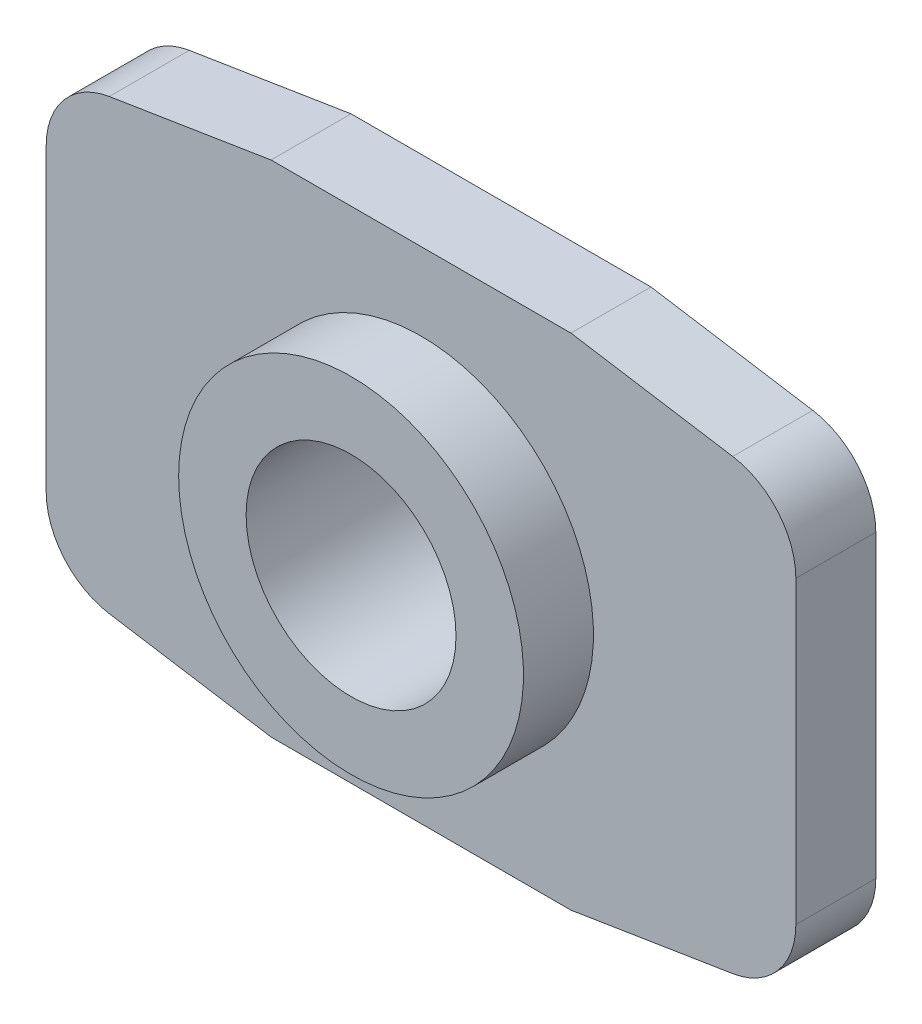
ISO-10303-21;
HEADER;
FILE_DESCRIPTION(('STEP AP214'),'2;1');
FILE_NAME('part.step','',(''),(''),'','','');
FILE_SCHEMA(('AUTOMOTIVE_DESIGN { 1 0 10303 214 1 1 1 1 }'));
ENDSEC;
DATA;
#1=APPLICATION_CONTEXT('core data for automotive mechanical design processes');
#2=APPLICATION_PROTOCOL_DEFINITION('international standard','automotive_design',2000,#1);
#3=PRODUCT_CONTEXT('',#1,'mechanical');
#4=PRODUCT('Part','Part','',(#3));
#5=PRODUCT_RELATED_PRODUCT_CATEGORY('part','',(#4));
#6=PRODUCT_DEFINITION_FORMATION('','',#4);
#7=PRODUCT_DEFINITION_CONTEXT('part definition',#1,'design');
#8=PRODUCT_DEFINITION('design','',#6,#7);
#9=PRODUCT_DEFINITION_SHAPE('','',#8);
#10=(LENGTH_UNIT() NAMED_UNIT(*) SI_UNIT(.MILLI.,.METRE.));
#11=(NAMED_UNIT(*) PLANE_ANGLE_UNIT() SI_UNIT($,.RADIAN.));
#12=(NAMED_UNIT(*) SI_UNIT($,.STERADIAN.) SOLID_ANGLE_UNIT());
#13=UNCERTAINTY_MEASURE_WITH_UNIT(LENGTH_MEASURE(1.E-05),#10,'distance_accuracy_value','');
#14=(GEOMETRIC_REPRESENTATION_CONTEXT(3) GLOBAL_UNCERTAINTY_ASSIGNED_CONTEXT((#13)) GLOBAL_UNIT_ASSIGNED_CONTEXT((#10,
#11,#12)) REPRESENTATION_CONTEXT('',''));
#15=CARTESIAN_POINT('',(0.,0.,0.));
#16=DIRECTION('',(0.,0.,1.));
#17=DIRECTION('',(1.,0.,0.));
#18=AXIS2_PLACEMENT_3D('',#15,#16,#17);
#19=CARTESIAN_POINT('',(-3.,-5.,0.));
#20=DIRECTION('',(0.,-1.,0.));
#21=DIRECTION('',(0.,0.,-1.));
#22=AXIS2_PLACEMENT_3D('',#19,#20,#21);
#23=PLANE('',#22);
#24=DIRECTION('',(1.,0.,0.));
#25=VECTOR('',#24,1.);
#26=CARTESIAN_POINT('',(-3.,-5.,1.6));
#27=LINE('',#26,#25);
#28=CARTESIAN_POINT('',(-3.,-5.,1.6));
#29=VERTEX_POINT('',#28);
#30=CARTESIAN_POINT('',(3.,-5.,1.6));
#31=VERTEX_POINT('',#30);
#32=EDGE_CURVE('E165',#29,#31,#27,.T.);
#33=ORIENTED_EDGE('',*,*,#32,.F.);
#34=DIRECTION('',(0.,0.,1.));
#35=VECTOR('',#34,1.);
#36=CARTESIAN_POINT('',(-3.,-5.,0.));
#37=LINE('',#36,#35);
#38=CARTESIAN_POINT('',(-3.,-5.,0.));
#39=VERTEX_POINT('',#38);
#40=EDGE_CURVE('E145',#39,#29,#37,.T.);
#41=ORIENTED_EDGE('',*,*,#40,.F.);
#42=DIRECTION('',(1.,0.,0.));
#43=VECTOR('',#42,1.);
#44=CARTESIAN_POINT('',(-3.,-5.,0.));
#45=LINE('',#44,#43);
#46=CARTESIAN_POINT('',(3.,-5.,0.));
#47=VERTEX_POINT('',#46);
#48=EDGE_CURVE('E140',#39,#47,#45,.T.);
#49=ORIENTED_EDGE('',*,*,#48,.T.);
#50=DIRECTION('',(0.,0.,1.));
#51=VECTOR('',#50,1.);
#52=CARTESIAN_POINT('',(3.,-5.,0.));
#53=LINE('',#52,#51);
#54=EDGE_CURVE('E122',#47,#31,#53,.T.);
#55=ORIENTED_EDGE('',*,*,#54,.T.);
#56=EDGE_LOOP('',(#33,#41,#49,#55));
#57=FACE_BOUND('',#56,.T.);
#58=ADVANCED_FACE('F32',(#57),#23,.T.);
#59=CARTESIAN_POINT('',(-7.5,-4.278719262151,0.));
#60=DIRECTION('',(-0.158264501869385,-0.987396752804077,0.));
#61=DIRECTION('',(0.987396752804077,-0.158264501869385,0.));
#62=AXIS2_PLACEMENT_3D('',#59,#60,#61);
#63=PLANE('',#62);
#64=DIRECTION('',(0.987396752804077,-0.158264501869385,0.));
#65=VECTOR('',#64,1.);
#66=CARTESIAN_POINT('',(-7.5,-4.278719262151,1.6));
#67=LINE('',#66,#65);
#68=CARTESIAN_POINT('',(-6.23739675280408,-4.48109512920611,1.6));
#69=VERTEX_POINT('',#68);
#70=EDGE_CURVE('E146',#69,#29,#67,.T.);
#71=ORIENTED_EDGE('',*,*,#70,.F.);
#72=DIRECTION('',(0.,0.,1.));
#73=VECTOR('',#72,1.);
#74=CARTESIAN_POINT('',(-6.23739675280408,-4.48109512920611,0.));
#75=LINE('',#74,#73);
#76=CARTESIAN_POINT('',(-6.23739675280408,-4.48109512920611,0.));
#77=VERTEX_POINT('',#76);
#78=EDGE_CURVE('E11',#69,#77,#75,.F.);
#79=ORIENTED_EDGE('',*,*,#78,.T.);
#80=DIRECTION('',(0.987396752804077,-0.158264501869385,0.));
#81=VECTOR('',#80,1.);
#82=CARTESIAN_POINT('',(-7.5,-4.278719262151,0.));
#83=LINE('',#82,#81);
#84=EDGE_CURVE('E134',#77,#39,#83,.T.);
#85=ORIENTED_EDGE('',*,*,#84,.T.);
#86=ORIENTED_EDGE('',*,*,#40,.T.);
#87=EDGE_LOOP('',(#71,#79,#85,#86));
#88=FACE_BOUND('',#87,.T.);
#89=ADVANCED_FACE('F257',(#88),#63,.T.);
#90=CARTESIAN_POINT('',(-7.5,4.27871926215099,0.));
#91=DIRECTION('',(-1.,0.,0.));
#92=DIRECTION('',(0.,-1.,0.));
#93=AXIS2_PLACEMENT_3D('',#90,#91,#92);
#94=PLANE('',#93);
#95=DIRECTION('',(0.,-1.,0.));
#96=VECTOR('',#95,1.);
#97=CARTESIAN_POINT('',(-7.5,4.27871926215099,1.6));
#98=LINE('',#97,#96);
#99=CARTESIAN_POINT('',(-7.5,3.,1.6));
#100=VERTEX_POINT('',#99);
#101=CARTESIAN_POINT('',(-7.5,-3.,1.6));
#102=VERTEX_POINT('',#101);
#103=EDGE_CURVE('E148',#100,#102,#98,.T.);
#104=ORIENTED_EDGE('',*,*,#103,.F.);
#105=DIRECTION('',(0.,0.,1.));
#106=VECTOR('',#105,1.);
#107=CARTESIAN_POINT('',(-7.5,3.,0.));
#108=LINE('',#107,#106);
#109=CARTESIAN_POINT('',(-7.5,3.,0.));
#110=VERTEX_POINT('',#109);
#111=EDGE_CURVE('E40',#100,#110,#108,.F.);
#112=ORIENTED_EDGE('',*,*,#111,.T.);
#113=DIRECTION('',(0.,-1.,0.));
#114=VECTOR('',#113,1.);
#115=CARTESIAN_POINT('',(-7.5,4.27871926215099,0.));
#116=LINE('',#115,#114);
#117=CARTESIAN_POINT('',(-7.5,-3.,0.));
#118=VERTEX_POINT('',#117);
#119=EDGE_CURVE('E161',#110,#118,#116,.T.);
#120=ORIENTED_EDGE('',*,*,#119,.T.);
#121=DIRECTION('',(0.,0.,1.));
#122=VECTOR('',#121,1.);
#123=CARTESIAN_POINT('',(-7.5,-3.,0.));
#124=LINE('',#123,#122);
#125=EDGE_CURVE('E214',#118,#102,#124,.T.);
#126=ORIENTED_EDGE('',*,*,#125,.T.);
#127=EDGE_LOOP('',(#104,#112,#120,#126));
#128=FACE_BOUND('',#127,.T.);
#129=ADVANCED_FACE('F219',(#128),#94,.T.);
#130=CARTESIAN_POINT('',(-3.,5.,0.));
#131=DIRECTION('',(-0.158264501869386,0.987396752804077,0.));
#132=DIRECTION('',(-0.987396752804077,-0.158264501869386,0.));
#133=AXIS2_PLACEMENT_3D('',#130,#131,#132);
#134=PLANE('',#133);
#135=DIRECTION('',(-0.987396752804077,-0.158264501869386,0.));
#136=VECTOR('',#135,1.);
#137=CARTESIAN_POINT('',(-3.,5.,0.));
#138=LINE('',#137,#136);
#139=CARTESIAN_POINT('',(-3.,5.,0.));
#140=VERTEX_POINT('',#139);
#141=CARTESIAN_POINT('',(-6.23739675280408,4.48109512920611,0.));
#142=VERTEX_POINT('',#141);
#143=EDGE_CURVE('E159',#140,#142,#138,.T.);
#144=ORIENTED_EDGE('',*,*,#143,.T.);
#145=DIRECTION('',(0.,0.,1.));
#146=VECTOR('',#145,1.);
#147=CARTESIAN_POINT('',(-6.23739675280408,4.48109512920611,0.));
#148=LINE('',#147,#146);
#149=CARTESIAN_POINT('',(-6.23739675280408,4.48109512920611,1.6));
#150=VERTEX_POINT('',#149);
#151=EDGE_CURVE('E211',#142,#150,#148,.T.);
#152=ORIENTED_EDGE('',*,*,#151,.T.);
#153=DIRECTION('',(-0.987396752804077,-0.158264501869386,0.));
#154=VECTOR('',#153,1.);
#155=CARTESIAN_POINT('',(-3.,5.,1.6));
#156=LINE('',#155,#154);
#157=CARTESIAN_POINT('',(-3.,5.,1.6));
#158=VERTEX_POINT('',#157);
#159=EDGE_CURVE('E174',#158,#150,#156,.T.);
#160=ORIENTED_EDGE('',*,*,#159,.F.);
#161=DIRECTION('',(0.,0.,1.));
#162=VECTOR('',#161,1.);
#163=CARTESIAN_POINT('',(-3.,5.,0.));
#164=LINE('',#163,#162);
#165=EDGE_CURVE('E181',#140,#158,#164,.T.);
#166=ORIENTED_EDGE('',*,*,#165,.F.);
#167=EDGE_LOOP('',(#144,#152,#160,#166));
#168=FACE_BOUND('',#167,.T.);
#169=ADVANCED_FACE('F227',(#168),#134,.T.);
#170=CARTESIAN_POINT('',(3.,5.,0.));
#171=DIRECTION('',(0.,1.,0.));
#172=DIRECTION('',(-1.,0.,0.));
#173=AXIS2_PLACEMENT_3D('',#170,#171,#172);
#174=PLANE('',#173);
#175=DIRECTION('',(-1.,0.,0.));
#176=VECTOR('',#175,1.);
#177=CARTESIAN_POINT('',(3.,5.,1.6));
#178=LINE('',#177,#176);
#179=CARTESIAN_POINT('',(3.,5.,1.6));
#180=VERTEX_POINT('',#179);
#181=EDGE_CURVE('E171',#180,#158,#178,.T.);
#182=ORIENTED_EDGE('',*,*,#181,.F.);
#183=DIRECTION('',(0.,0.,1.));
#184=VECTOR('',#183,1.);
#185=CARTESIAN_POINT('',(3.,5.,0.));
#186=LINE('',#185,#184);
#187=CARTESIAN_POINT('',(3.,5.,0.));
#188=VERTEX_POINT('',#187);
#189=EDGE_CURVE('E133',#188,#180,#186,.T.);
#190=ORIENTED_EDGE('',*,*,#189,.F.);
#191=DIRECTION('',(-1.,0.,0.));
#192=VECTOR('',#191,1.);
#193=CARTESIAN_POINT('',(3.,5.,0.));
#194=LINE('',#193,#192);
#195=EDGE_CURVE('E156',#188,#140,#194,.T.);
#196=ORIENTED_EDGE('',*,*,#195,.T.);
#197=ORIENTED_EDGE('',*,*,#165,.T.);
#198=EDGE_LOOP('',(#182,#190,#196,#197));
#199=FACE_BOUND('',#198,.T.);
#200=ADVANCED_FACE('F234',(#199),#174,.T.);
#201=CARTESIAN_POINT('',(7.5,4.278719262151,0.));
#202=DIRECTION('',(0.158264501869385,0.987396752804077,0.));
#203=DIRECTION('',(-0.987396752804077,0.158264501869385,0.));
#204=AXIS2_PLACEMENT_3D('',#201,#202,#203);
#205=PLANE('',#204);
#206=DIRECTION('',(-0.987396752804077,0.158264501869385,0.));
#207=VECTOR('',#206,1.);
#208=CARTESIAN_POINT('',(7.5,4.278719262151,1.6));
#209=LINE('',#208,#207);
#210=CARTESIAN_POINT('',(6.23739675280408,4.48109512920611,1.6));
#211=VERTEX_POINT('',#210);
#212=EDGE_CURVE('E169',#211,#180,#209,.T.);
#213=ORIENTED_EDGE('',*,*,#212,.F.);
#214=DIRECTION('',(0.,0.,1.));
#215=VECTOR('',#214,1.);
#216=CARTESIAN_POINT('',(6.23739675280408,4.48109512920611,0.));
#217=LINE('',#216,#215);
#218=CARTESIAN_POINT('',(6.23739675280408,4.48109512920611,0.));
#219=VERTEX_POINT('',#218);
#220=EDGE_CURVE('E201',#211,#219,#217,.F.);
#221=ORIENTED_EDGE('',*,*,#220,.T.);
#222=DIRECTION('',(-0.987396752804077,0.158264501869385,0.));
#223=VECTOR('',#222,1.);
#224=CARTESIAN_POINT('',(7.5,4.278719262151,0.));
#225=LINE('',#224,#223);
#226=EDGE_CURVE('E154',#219,#188,#225,.T.);
#227=ORIENTED_EDGE('',*,*,#226,.T.);
#228=ORIENTED_EDGE('',*,*,#189,.T.);
#229=EDGE_LOOP('',(#213,#221,#227,#228));
#230=FACE_BOUND('',#229,.T.);
#231=ADVANCED_FACE('F268',(#230),#205,.T.);
#232=CARTESIAN_POINT('',(7.5,4.278719262151,0.));
#233=DIRECTION('',(1.,0.,0.));
#234=DIRECTION('',(0.,1.,0.));
#235=AXIS2_PLACEMENT_3D('',#232,#233,#234);
#236=PLANE('',#235);
#237=DIRECTION('',(0.,1.,0.));
#238=VECTOR('',#237,1.);
#239=CARTESIAN_POINT('',(7.5,4.278719262151,0.));
#240=LINE('',#239,#238);
#241=CARTESIAN_POINT('',(7.50000000000002,-2.99999999999999,0.));
#242=VERTEX_POINT('',#241);
#243=CARTESIAN_POINT('',(7.5,3.,0.));
#244=VERTEX_POINT('',#243);
#245=EDGE_CURVE('E141',#242,#244,#240,.T.);
#246=ORIENTED_EDGE('',*,*,#245,.T.);
#247=DIRECTION('',(0.,0.,1.));
#248=VECTOR('',#247,1.);
#249=CARTESIAN_POINT('',(7.5,3.,0.));
#250=LINE('',#249,#248);
#251=CARTESIAN_POINT('',(7.5,3.,1.6));
#252=VERTEX_POINT('',#251);
#253=EDGE_CURVE('E190',#244,#252,#250,.T.);
#254=ORIENTED_EDGE('',*,*,#253,.T.);
#255=DIRECTION('',(0.,1.,0.));
#256=VECTOR('',#255,1.);
#257=CARTESIAN_POINT('',(7.5,4.278719262151,1.6));
#258=LINE('',#257,#256);
#259=CARTESIAN_POINT('',(7.50000000000002,-2.99999999999999,1.6));
#260=VERTEX_POINT('',#259);
#261=EDGE_CURVE('E168',#260,#252,#258,.T.);
#262=ORIENTED_EDGE('',*,*,#261,.F.);
#263=DIRECTION('',(0.,0.,1.));
#264=VECTOR('',#263,1.);
#265=CARTESIAN_POINT('',(7.50000000000002,-2.99999999999999,0.));
#266=LINE('',#265,#264);
#267=EDGE_CURVE('E180',#260,#242,#266,.F.);
#268=ORIENTED_EDGE('',*,*,#267,.T.);
#269=EDGE_LOOP('',(#246,#254,#262,#268));
#270=FACE_BOUND('',#269,.T.);
#271=ADVANCED_FACE('F244',(#270),#236,.T.);
#272=CARTESIAN_POINT('',(3.,-5.,0.));
#273=DIRECTION('',(0.158264501869385,-0.987396752804077,0.));
#274=DIRECTION('',(0.987396752804077,0.158264501869385,0.));
#275=AXIS2_PLACEMENT_3D('',#272,#273,#274);
#276=PLANE('',#275);
#277=DIRECTION('',(0.987396752804077,0.158264501869385,0.));
#278=VECTOR('',#277,1.);
#279=CARTESIAN_POINT('',(3.,-5.,0.));
#280=LINE('',#279,#278);
#281=CARTESIAN_POINT('',(6.2373967528041,-4.48109512920611,0.));
#282=VERTEX_POINT('',#281);
#283=EDGE_CURVE('E125',#47,#282,#280,.T.);
#284=ORIENTED_EDGE('',*,*,#283,.T.);
#285=DIRECTION('',(0.,0.,1.));
#286=VECTOR('',#285,1.);
#287=CARTESIAN_POINT('',(6.2373967528041,-4.48109512920611,0.));
#288=LINE('',#287,#286);
#289=CARTESIAN_POINT('',(6.2373967528041,-4.48109512920611,1.6));
#290=VERTEX_POINT('',#289);
#291=EDGE_CURVE('E209',#282,#290,#288,.T.);
#292=ORIENTED_EDGE('',*,*,#291,.T.);
#293=DIRECTION('',(0.987396752804077,0.158264501869385,0.));
#294=VECTOR('',#293,1.);
#295=CARTESIAN_POINT('',(3.,-5.,1.6));
#296=LINE('',#295,#294);
#297=EDGE_CURVE('E128',#31,#290,#296,.T.);
#298=ORIENTED_EDGE('',*,*,#297,.F.);
#299=ORIENTED_EDGE('',*,*,#54,.F.);
#300=EDGE_LOOP('',(#284,#292,#298,#299));
#301=FACE_BOUND('',#300,.T.);
#302=ADVANCED_FACE('F123',(#301),#276,.T.);
#303=CARTESIAN_POINT('',(0.,0.,0.));
#304=DIRECTION('',(0.,0.,-1.));
#305=DIRECTION('',(-1.,0.,0.));
#306=AXIS2_PLACEMENT_3D('',#303,#304,#305);
#307=PLANE('',#306);
#308=CARTESIAN_POINT('',(0.,0.,0.));
#309=DIRECTION('',(0.,0.,1.));
#310=DIRECTION('',(1.,0.,0.));
#311=AXIS2_PLACEMENT_3D('',#308,#309,#310);
#312=CIRCLE('',#311,2.10000000000001);
#313=CARTESIAN_POINT('',(2.10000000000001,0.,0.));
#314=VERTEX_POINT('',#313);
#315=EDGE_CURVE('E303',#314,#314,#312,.T.);
#316=ORIENTED_EDGE('',*,*,#315,.T.);
#317=EDGE_LOOP('',(#316));
#318=FACE_BOUND('',#317,.T.);
#319=ORIENTED_EDGE('',*,*,#226,.F.);
#320=CARTESIAN_POINT('',(6.,3.,0.));
#321=DIRECTION('',(0.,0.,-1.));
#322=DIRECTION('',(-1.,0.,0.));
#323=AXIS2_PLACEMENT_3D('',#320,#321,#322);
#324=CIRCLE('',#323,1.5);
#325=EDGE_CURVE('E207',#219,#244,#324,.T.);
#326=ORIENTED_EDGE('',*,*,#325,.T.);
#327=ORIENTED_EDGE('',*,*,#245,.F.);
#328=CARTESIAN_POINT('',(6.00000000000002,-2.99999999999999,0.));
#329=DIRECTION('',(0.,0.,-1.));
#330=DIRECTION('',(-1.,0.,0.));
#331=AXIS2_PLACEMENT_3D('',#328,#329,#330);
#332=CIRCLE('',#331,1.5);
#333=EDGE_CURVE('E47',#242,#282,#332,.T.);
#334=ORIENTED_EDGE('',*,*,#333,.T.);
#335=ORIENTED_EDGE('',*,*,#283,.F.);
#336=ORIENTED_EDGE('',*,*,#48,.F.);
#337=ORIENTED_EDGE('',*,*,#84,.F.);
#338=CARTESIAN_POINT('',(-6.,-3.,0.));
#339=DIRECTION('',(0.,0.,-1.));
#340=DIRECTION('',(-1.,0.,0.));
#341=AXIS2_PLACEMENT_3D('',#338,#339,#340);
#342=CIRCLE('',#341,1.5);
#343=EDGE_CURVE('E203',#77,#118,#342,.T.);
#344=ORIENTED_EDGE('',*,*,#343,.T.);
#345=ORIENTED_EDGE('',*,*,#119,.F.);
#346=CARTESIAN_POINT('',(-6.,3.,0.));
#347=DIRECTION('',(0.,0.,-1.));
#348=DIRECTION('',(-1.,0.,0.));
#349=AXIS2_PLACEMENT_3D('',#346,#347,#348);
#350=CIRCLE('',#349,1.5);
#351=EDGE_CURVE('E54',#110,#142,#350,.T.);
#352=ORIENTED_EDGE('',*,*,#351,.T.);
#353=ORIENTED_EDGE('',*,*,#143,.F.);
#354=ORIENTED_EDGE('',*,*,#195,.F.);
#355=EDGE_LOOP('',(#319,#326,#327,#334,#335,#336,#337,#344,#345,#352,#353,#354));
#356=FACE_BOUND('',#355,.T.);
#357=ADVANCED_FACE('F138',(#318,#356),#307,.T.);
#358=CARTESIAN_POINT('',(0.,0.,1.6));
#359=DIRECTION('',(0.,0.,-1.));
#360=DIRECTION('',(-1.,0.,0.));
#361=AXIS2_PLACEMENT_3D('',#358,#359,#360);
#362=PLANE('',#361);
#363=CARTESIAN_POINT('',(0.,0.,1.6));
#364=DIRECTION('',(0.,0.,-1.));
#365=DIRECTION('',(-1.,0.,0.));
#366=AXIS2_PLACEMENT_3D('',#363,#364,#365);
#367=CIRCLE('',#366,3.45);
#368=CARTESIAN_POINT('',(-3.45,0.,1.6));
#369=VERTEX_POINT('',#368);
#370=EDGE_CURVE('E308',#369,#369,#367,.T.);
#371=ORIENTED_EDGE('',*,*,#370,.T.);
#372=EDGE_LOOP('',(#371));
#373=FACE_BOUND('',#372,.T.);
#374=ORIENTED_EDGE('',*,*,#261,.T.);
#375=CARTESIAN_POINT('',(6.,3.,1.6));
#376=DIRECTION('',(0.,0.,-1.));
#377=DIRECTION('',(-1.,0.,0.));
#378=AXIS2_PLACEMENT_3D('',#375,#376,#377);
#379=CIRCLE('',#378,1.5);
#380=EDGE_CURVE('E199',#252,#211,#379,.F.);
#381=ORIENTED_EDGE('',*,*,#380,.T.);
#382=ORIENTED_EDGE('',*,*,#212,.T.);
#383=ORIENTED_EDGE('',*,*,#181,.T.);
#384=ORIENTED_EDGE('',*,*,#159,.T.);
#385=CARTESIAN_POINT('',(-6.,3.,1.6));
#386=DIRECTION('',(0.,0.,-1.));
#387=DIRECTION('',(-1.,0.,0.));
#388=AXIS2_PLACEMENT_3D('',#385,#386,#387);
#389=CIRCLE('',#388,1.5);
#390=EDGE_CURVE('E195',#150,#100,#389,.F.);
#391=ORIENTED_EDGE('',*,*,#390,.T.);
#392=ORIENTED_EDGE('',*,*,#103,.T.);
#393=CARTESIAN_POINT('',(-6.,-3.,1.6));
#394=DIRECTION('',(0.,0.,-1.));
#395=DIRECTION('',(-1.,0.,0.));
#396=AXIS2_PLACEMENT_3D('',#393,#394,#395);
#397=CIRCLE('',#396,1.5);
#398=EDGE_CURVE('E193',#102,#69,#397,.F.);
#399=ORIENTED_EDGE('',*,*,#398,.T.);
#400=ORIENTED_EDGE('',*,*,#70,.T.);
#401=ORIENTED_EDGE('',*,*,#32,.T.);
#402=ORIENTED_EDGE('',*,*,#297,.T.);
#403=CARTESIAN_POINT('',(6.00000000000002,-2.99999999999999,1.6));
#404=DIRECTION('',(0.,0.,-1.));
#405=DIRECTION('',(-1.,0.,0.));
#406=AXIS2_PLACEMENT_3D('',#403,#404,#405);
#407=CIRCLE('',#406,1.5);
#408=EDGE_CURVE('E197',#290,#260,#407,.F.);
#409=ORIENTED_EDGE('',*,*,#408,.T.);
#410=EDGE_LOOP('',(#374,#381,#382,#383,#384,#391,#392,#399,#400,#401,#402,#409));
#411=FACE_BOUND('',#410,.T.);
#412=ADVANCED_FACE('F229',(#373,#411),#362,.F.);
#413=CARTESIAN_POINT('',(0.,0.,3.));
#414=DIRECTION('',(0.,0.,-1.));
#415=DIRECTION('',(-1.,0.,0.));
#416=AXIS2_PLACEMENT_3D('',#413,#414,#415);
#417=CYLINDRICAL_SURFACE('',#416,3.45);
#418=CARTESIAN_POINT('',(0.,0.,3.));
#419=DIRECTION('',(0.,0.,-1.));
#420=DIRECTION('',(-1.,0.,0.));
#421=AXIS2_PLACEMENT_3D('',#418,#419,#420);
#422=CIRCLE('',#421,3.45);
#423=CARTESIAN_POINT('',(-3.45,0.,3.));
#424=VERTEX_POINT('',#423);
#425=EDGE_CURVE('E151',#424,#424,#422,.T.);
#426=ORIENTED_EDGE('',*,*,#425,.T.);
#427=EDGE_LOOP('',(#426));
#428=FACE_BOUND('',#427,.T.);
#429=ORIENTED_EDGE('',*,*,#370,.F.);
#430=EDGE_LOOP('',(#429));
#431=FACE_BOUND('',#430,.T.);
#432=ADVANCED_FACE('F284',(#428,#431),#417,.T.);
#433=CARTESIAN_POINT('',(3.45,0.,3.));
#434=DIRECTION('',(0.,0.,1.));
#435=DIRECTION('',(1.,0.,0.));
#436=AXIS2_PLACEMENT_3D('',#433,#434,#435);
#437=PLANE('',#436);
#438=CARTESIAN_POINT('',(0.,0.,3.));
#439=DIRECTION('',(0.,0.,1.));
#440=DIRECTION('',(1.,0.,0.));
#441=AXIS2_PLACEMENT_3D('',#438,#439,#440);
#442=CIRCLE('',#441,2.10000000000001);
#443=CARTESIAN_POINT('',(2.10000000000001,0.,3.));
#444=VERTEX_POINT('',#443);
#445=EDGE_CURVE('E306',#444,#444,#442,.T.);
#446=ORIENTED_EDGE('',*,*,#445,.F.);
#447=EDGE_LOOP('',(#446));
#448=FACE_BOUND('',#447,.T.);
#449=ORIENTED_EDGE('',*,*,#425,.F.);
#450=EDGE_LOOP('',(#449));
#451=FACE_BOUND('',#450,.T.);
#452=ADVANCED_FACE('F291',(#448,#451),#437,.T.);
#453=CARTESIAN_POINT('',(0.,0.,3.));
#454=DIRECTION('',(0.,0.,1.));
#455=DIRECTION('',(1.,0.,0.));
#456=AXIS2_PLACEMENT_3D('',#453,#454,#455);
#457=CYLINDRICAL_SURFACE('',#456,2.10000000000001);
#458=ORIENTED_EDGE('',*,*,#315,.F.);
#459=EDGE_LOOP('',(#458));
#460=FACE_BOUND('',#459,.T.);
#461=ORIENTED_EDGE('',*,*,#445,.T.);
#462=EDGE_LOOP('',(#461));
#463=FACE_BOUND('',#462,.T.);
#464=ADVANCED_FACE('F254',(#460,#463),#457,.F.);
#465=CARTESIAN_POINT('',(6.,3.,0.));
#466=DIRECTION('',(0.,0.,1.));
#467=DIRECTION('',(1.,0.,0.));
#468=AXIS2_PLACEMENT_3D('',#465,#466,#467);
#469=CYLINDRICAL_SURFACE('',#468,1.5);
#470=ORIENTED_EDGE('',*,*,#325,.F.);
#471=ORIENTED_EDGE('',*,*,#220,.F.);
#472=ORIENTED_EDGE('',*,*,#380,.F.);
#473=ORIENTED_EDGE('',*,*,#253,.F.);
#474=EDGE_LOOP('',(#470,#471,#472,#473));
#475=FACE_BOUND('',#474,.T.);
#476=ADVANCED_FACE('F241',(#475),#469,.T.);
#477=CARTESIAN_POINT('',(6.00000000000002,-2.99999999999999,0.));
#478=DIRECTION('',(0.,0.,1.));
#479=DIRECTION('',(1.,0.,0.));
#480=AXIS2_PLACEMENT_3D('',#477,#478,#479);
#481=CYLINDRICAL_SURFACE('',#480,1.5);
#482=ORIENTED_EDGE('',*,*,#333,.F.);
#483=ORIENTED_EDGE('',*,*,#267,.F.);
#484=ORIENTED_EDGE('',*,*,#408,.F.);
#485=ORIENTED_EDGE('',*,*,#291,.F.);
#486=EDGE_LOOP('',(#482,#483,#484,#485));
#487=FACE_BOUND('',#486,.T.);
#488=ADVANCED_FACE('F247',(#487),#481,.T.);
#489=CARTESIAN_POINT('',(-6.,3.,0.));
#490=DIRECTION('',(0.,0.,1.));
#491=DIRECTION('',(1.,0.,0.));
#492=AXIS2_PLACEMENT_3D('',#489,#490,#491);
#493=CYLINDRICAL_SURFACE('',#492,1.5);
#494=ORIENTED_EDGE('',*,*,#351,.F.);
#495=ORIENTED_EDGE('',*,*,#111,.F.);
#496=ORIENTED_EDGE('',*,*,#390,.F.);
#497=ORIENTED_EDGE('',*,*,#151,.F.);
#498=EDGE_LOOP('',(#494,#495,#496,#497));
#499=FACE_BOUND('',#498,.T.);
#500=ADVANCED_FACE('F224',(#499),#493,.T.);
#501=CARTESIAN_POINT('',(-6.,-3.,0.));
#502=DIRECTION('',(0.,0.,1.));
#503=DIRECTION('',(1.,0.,0.));
#504=AXIS2_PLACEMENT_3D('',#501,#502,#503);
#505=CYLINDRICAL_SURFACE('',#504,1.5);
#506=ORIENTED_EDGE('',*,*,#343,.F.);
#507=ORIENTED_EDGE('',*,*,#78,.F.);
#508=ORIENTED_EDGE('',*,*,#398,.F.);
#509=ORIENTED_EDGE('',*,*,#125,.F.);
#510=EDGE_LOOP('',(#506,#507,#508,#509));
#511=FACE_BOUND('',#510,.T.);
#512=ADVANCED_FACE('F34',(#511),#505,.T.);
#513=CLOSED_SHELL('',(#58,#89,#129,#169,#200,#231,#271,#302,#357,#412,#432,#452,#464,#476,#488,
#500,#512));
#514=MANIFOLD_SOLID_BREP('B2',#513);
#515=ADVANCED_BREP_SHAPE_REPRESENTATION('',(#18,#514),#14);
#516=SHAPE_DEFINITION_REPRESENTATION(#9,#515);
ENDSEC;
END-ISO-10303-21;
